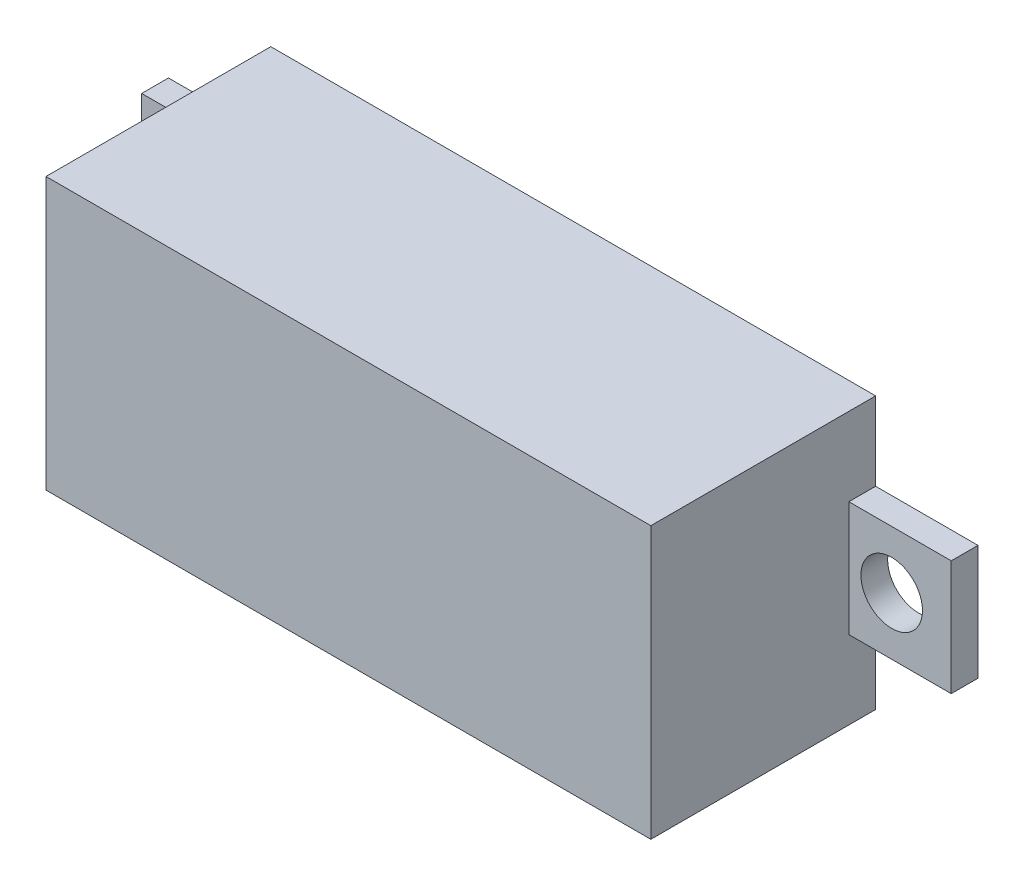
ISO-10303-21;
HEADER;
FILE_DESCRIPTION(('STEP AP214'),'2;1');
FILE_NAME('part.step','',(''),(''),'','','');
FILE_SCHEMA(('AUTOMOTIVE_DESIGN { 1 0 10303 214 1 1 1 1 }'));
ENDSEC;
DATA;
#1=APPLICATION_CONTEXT('core data for automotive mechanical design processes');
#2=APPLICATION_PROTOCOL_DEFINITION('international standard','automotive_design',2000,#1);
#3=PRODUCT_CONTEXT('',#1,'mechanical');
#4=PRODUCT('Part','Part','',(#3));
#5=PRODUCT_RELATED_PRODUCT_CATEGORY('part','',(#4));
#6=PRODUCT_DEFINITION_FORMATION('','',#4);
#7=PRODUCT_DEFINITION_CONTEXT('part definition',#1,'design');
#8=PRODUCT_DEFINITION('design','',#6,#7);
#9=PRODUCT_DEFINITION_SHAPE('','',#8);
#10=(LENGTH_UNIT() NAMED_UNIT(*) SI_UNIT(.MILLI.,.METRE.));
#11=(NAMED_UNIT(*) PLANE_ANGLE_UNIT() SI_UNIT($,.RADIAN.));
#12=(NAMED_UNIT(*) SI_UNIT($,.STERADIAN.) SOLID_ANGLE_UNIT());
#13=UNCERTAINTY_MEASURE_WITH_UNIT(LENGTH_MEASURE(1.E-05),#10,'distance_accuracy_value','');
#14=(GEOMETRIC_REPRESENTATION_CONTEXT(3) GLOBAL_UNCERTAINTY_ASSIGNED_CONTEXT((#13)) GLOBAL_UNIT_ASSIGNED_CONTEXT((#10,
#11,#12)) REPRESENTATION_CONTEXT('',''));
#15=CARTESIAN_POINT('',(0.,0.,0.));
#16=DIRECTION('',(0.,0.,1.));
#17=DIRECTION('',(1.,0.,0.));
#18=AXIS2_PLACEMENT_3D('',#15,#16,#17);
#19=CARTESIAN_POINT('',(0.,0.,1.));
#20=DIRECTION('',(0.,0.,1.));
#21=DIRECTION('',(1.,0.,0.));
#22=AXIS2_PLACEMENT_3D('',#19,#20,#21);
#23=PLANE('',#22);
#24=DIRECTION('',(0.,-1.,0.));
#25=VECTOR('',#24,1.);
#26=CARTESIAN_POINT('',(11.3,2.15,1.));
#27=LINE('',#26,#25);
#28=CARTESIAN_POINT('',(11.3,2.15,1.));
#29=VERTEX_POINT('',#28);
#30=CARTESIAN_POINT('',(11.3,-2.15,1.));
#31=VERTEX_POINT('',#30);
#32=EDGE_CURVE('E96',#29,#31,#27,.T.);
#33=ORIENTED_EDGE('',*,*,#32,.T.);
#34=DIRECTION('',(1.,0.,0.));
#35=VECTOR('',#34,1.);
#36=CARTESIAN_POINT('',(11.3,-2.15,1.));
#37=LINE('',#36,#35);
#38=CARTESIAN_POINT('',(15.125,-2.15,1.));
#39=VERTEX_POINT('',#38);
#40=EDGE_CURVE('E91',#31,#39,#37,.T.);
#41=ORIENTED_EDGE('',*,*,#40,.T.);
#42=DIRECTION('',(0.,1.,0.));
#43=VECTOR('',#42,1.);
#44=CARTESIAN_POINT('',(15.125,2.15,1.));
#45=LINE('',#44,#43);
#46=CARTESIAN_POINT('',(15.125,2.15,1.));
#47=VERTEX_POINT('',#46);
#48=EDGE_CURVE('E94',#39,#47,#45,.T.);
#49=ORIENTED_EDGE('',*,*,#48,.T.);
#50=DIRECTION('',(-1.,0.,0.));
#51=VECTOR('',#50,1.);
#52=CARTESIAN_POINT('',(11.3,2.15,1.));
#53=LINE('',#52,#51);
#54=EDGE_CURVE('E61',#47,#29,#53,.T.);
#55=ORIENTED_EDGE('',*,*,#54,.T.);
#56=EDGE_LOOP('',(#33,#41,#49,#55));
#57=FACE_BOUND('',#56,.T.);
#58=CARTESIAN_POINT('',(12.9,0.,1.));
#59=DIRECTION('',(0.,0.,1.));
#60=DIRECTION('',(1.,0.,0.));
#61=AXIS2_PLACEMENT_3D('',#58,#59,#60);
#62=CIRCLE('',#61,1.15);
#63=CARTESIAN_POINT('',(14.05,0.,1.));
#64=VERTEX_POINT('',#63);
#65=EDGE_CURVE('E111',#64,#64,#62,.T.);
#66=ORIENTED_EDGE('',*,*,#65,.F.);
#67=EDGE_LOOP('',(#66));
#68=FACE_BOUND('',#67,.T.);
#69=ADVANCED_FACE('F44',(#57,#68),#23,.T.);
#70=CARTESIAN_POINT('',(0.,0.,0.));
#71=DIRECTION('',(0.,0.,1.));
#72=DIRECTION('',(1.,0.,0.));
#73=AXIS2_PLACEMENT_3D('',#70,#71,#72);
#74=PLANE('',#73);
#75=DIRECTION('',(0.,-1.,0.));
#76=VECTOR('',#75,1.);
#77=CARTESIAN_POINT('',(11.3,2.15,0.));
#78=LINE('',#77,#76);
#79=CARTESIAN_POINT('',(11.3,2.15,0.));
#80=VERTEX_POINT('',#79);
#81=CARTESIAN_POINT('',(11.3,-2.15,0.));
#82=VERTEX_POINT('',#81);
#83=EDGE_CURVE('E108',#80,#82,#78,.T.);
#84=ORIENTED_EDGE('',*,*,#83,.F.);
#85=DIRECTION('',(-1.,0.,0.));
#86=VECTOR('',#85,1.);
#87=CARTESIAN_POINT('',(11.3,2.15,0.));
#88=LINE('',#87,#86);
#89=CARTESIAN_POINT('',(15.125,2.15,0.));
#90=VERTEX_POINT('',#89);
#91=EDGE_CURVE('E84',#90,#80,#88,.T.);
#92=ORIENTED_EDGE('',*,*,#91,.F.);
#93=DIRECTION('',(0.,1.,0.));
#94=VECTOR('',#93,1.);
#95=CARTESIAN_POINT('',(15.125,2.15,0.));
#96=LINE('',#95,#94);
#97=CARTESIAN_POINT('',(15.125,-2.15,0.));
#98=VERTEX_POINT('',#97);
#99=EDGE_CURVE('E78',#98,#90,#96,.T.);
#100=ORIENTED_EDGE('',*,*,#99,.F.);
#101=DIRECTION('',(1.,0.,0.));
#102=VECTOR('',#101,1.);
#103=CARTESIAN_POINT('',(11.3,-2.15,0.));
#104=LINE('',#103,#102);
#105=EDGE_CURVE('E100',#82,#98,#104,.T.);
#106=ORIENTED_EDGE('',*,*,#105,.F.);
#107=EDGE_LOOP('',(#84,#92,#100,#106));
#108=FACE_BOUND('',#107,.T.);
#109=CARTESIAN_POINT('',(12.9,0.,0.));
#110=DIRECTION('',(0.,0.,1.));
#111=DIRECTION('',(1.,0.,0.));
#112=AXIS2_PLACEMENT_3D('',#109,#110,#111);
#113=CIRCLE('',#112,1.15);
#114=CARTESIAN_POINT('',(14.05,0.,0.));
#115=VERTEX_POINT('',#114);
#116=EDGE_CURVE('E123',#115,#115,#113,.T.);
#117=ORIENTED_EDGE('',*,*,#116,.T.);
#118=EDGE_LOOP('',(#117));
#119=FACE_BOUND('',#118,.T.);
#120=ADVANCED_FACE('F119',(#108,#119),#74,.F.);
#121=CARTESIAN_POINT('',(11.3,2.15,1.));
#122=DIRECTION('',(1.,0.,0.));
#123=DIRECTION('',(0.,0.,-1.));
#124=AXIS2_PLACEMENT_3D('',#121,#122,#123);
#125=PLANE('',#124);
#126=ORIENTED_EDGE('',*,*,#83,.T.);
#127=DIRECTION('',(0.,0.,-1.));
#128=VECTOR('',#127,1.);
#129=CARTESIAN_POINT('',(11.3,-2.15,1.));
#130=LINE('',#129,#128);
#131=EDGE_CURVE('E12',#31,#82,#130,.T.);
#132=ORIENTED_EDGE('',*,*,#131,.F.);
#133=ORIENTED_EDGE('',*,*,#32,.F.);
#134=DIRECTION('',(0.,0.,-1.));
#135=VECTOR('',#134,1.);
#136=CARTESIAN_POINT('',(11.3,2.15,1.));
#137=LINE('',#136,#135);
#138=EDGE_CURVE('E104',#29,#80,#137,.T.);
#139=ORIENTED_EDGE('',*,*,#138,.T.);
#140=EDGE_LOOP('',(#126,#132,#133,#139));
#141=FACE_BOUND('',#140,.T.);
#142=ADVANCED_FACE('F46',(#141),#125,.F.);
#143=CARTESIAN_POINT('',(11.3,-2.15,1.));
#144=DIRECTION('',(0.,1.,0.));
#145=DIRECTION('',(0.,0.,1.));
#146=AXIS2_PLACEMENT_3D('',#143,#144,#145);
#147=PLANE('',#146);
#148=ORIENTED_EDGE('',*,*,#105,.T.);
#149=DIRECTION('',(0.,0.,-1.));
#150=VECTOR('',#149,1.);
#151=CARTESIAN_POINT('',(15.125,-2.15,1.));
#152=LINE('',#151,#150);
#153=EDGE_CURVE('E53',#39,#98,#152,.T.);
#154=ORIENTED_EDGE('',*,*,#153,.F.);
#155=ORIENTED_EDGE('',*,*,#40,.F.);
#156=ORIENTED_EDGE('',*,*,#131,.T.);
#157=EDGE_LOOP('',(#148,#154,#155,#156));
#158=FACE_BOUND('',#157,.T.);
#159=ADVANCED_FACE('F99',(#158),#147,.F.);
#160=CARTESIAN_POINT('',(15.125,2.15,1.));
#161=DIRECTION('',(-1.,0.,0.));
#162=DIRECTION('',(0.,0.,1.));
#163=AXIS2_PLACEMENT_3D('',#160,#161,#162);
#164=PLANE('',#163);
#165=ORIENTED_EDGE('',*,*,#99,.T.);
#166=DIRECTION('',(0.,0.,-1.));
#167=VECTOR('',#166,1.);
#168=CARTESIAN_POINT('',(15.125,2.15,1.));
#169=LINE('',#168,#167);
#170=EDGE_CURVE('E101',#47,#90,#169,.T.);
#171=ORIENTED_EDGE('',*,*,#170,.F.);
#172=ORIENTED_EDGE('',*,*,#48,.F.);
#173=ORIENTED_EDGE('',*,*,#153,.T.);
#174=EDGE_LOOP('',(#165,#171,#172,#173));
#175=FACE_BOUND('',#174,.T.);
#176=ADVANCED_FACE('F102',(#175),#164,.F.);
#177=CARTESIAN_POINT('',(11.3,2.15,1.));
#178=DIRECTION('',(0.,-1.,0.));
#179=DIRECTION('',(0.,0.,-1.));
#180=AXIS2_PLACEMENT_3D('',#177,#178,#179);
#181=PLANE('',#180);
#182=ORIENTED_EDGE('',*,*,#91,.T.);
#183=ORIENTED_EDGE('',*,*,#138,.F.);
#184=ORIENTED_EDGE('',*,*,#54,.F.);
#185=ORIENTED_EDGE('',*,*,#170,.T.);
#186=EDGE_LOOP('',(#182,#183,#184,#185));
#187=FACE_BOUND('',#186,.T.);
#188=ADVANCED_FACE('F116',(#187),#181,.F.);
#189=CARTESIAN_POINT('',(12.9,0.,1.));
#190=DIRECTION('',(0.,0.,-1.));
#191=DIRECTION('',(-1.,0.,0.));
#192=AXIS2_PLACEMENT_3D('',#189,#190,#191);
#193=CYLINDRICAL_SURFACE('',#192,1.15);
#194=ORIENTED_EDGE('',*,*,#65,.T.);
#195=EDGE_LOOP('',(#194));
#196=FACE_BOUND('',#195,.T.);
#197=ORIENTED_EDGE('',*,*,#116,.F.);
#198=EDGE_LOOP('',(#197));
#199=FACE_BOUND('',#198,.T.);
#200=ADVANCED_FACE('F129',(#196,#199),#193,.F.);
#201=CLOSED_SHELL('',(#69,#120,#142,#159,#176,#188,#200));
#202=MANIFOLD_SOLID_BREP('B2',#201);
#203=CARTESIAN_POINT('',(0.,0.,1.));
#204=DIRECTION('',(0.,0.,-1.));
#205=DIRECTION('',(-1.,0.,0.));
#206=AXIS2_PLACEMENT_3D('',#203,#204,#205);
#207=PLANE('',#206);
#208=DIRECTION('',(0.,1.,0.));
#209=VECTOR('',#208,1.);
#210=CARTESIAN_POINT('',(-11.3,2.15,1.));
#211=LINE('',#210,#209);
#212=CARTESIAN_POINT('',(-11.3,-2.15,1.));
#213=VERTEX_POINT('',#212);
#214=CARTESIAN_POINT('',(-11.3,2.15,1.));
#215=VERTEX_POINT('',#214);
#216=EDGE_CURVE('E250',#213,#215,#211,.T.);
#217=ORIENTED_EDGE('',*,*,#216,.T.);
#218=DIRECTION('',(-1.,0.,0.));
#219=VECTOR('',#218,1.);
#220=CARTESIAN_POINT('',(-11.3,2.15,1.));
#221=LINE('',#220,#219);
#222=CARTESIAN_POINT('',(-15.125,2.15,1.));
#223=VERTEX_POINT('',#222);
#224=EDGE_CURVE('E245',#215,#223,#221,.T.);
#225=ORIENTED_EDGE('',*,*,#224,.T.);
#226=DIRECTION('',(0.,-1.,0.));
#227=VECTOR('',#226,1.);
#228=CARTESIAN_POINT('',(-15.125,2.15,1.));
#229=LINE('',#228,#227);
#230=CARTESIAN_POINT('',(-15.125,-2.15,1.));
#231=VERTEX_POINT('',#230);
#232=EDGE_CURVE('E248',#223,#231,#229,.T.);
#233=ORIENTED_EDGE('',*,*,#232,.T.);
#234=DIRECTION('',(1.,0.,0.));
#235=VECTOR('',#234,1.);
#236=CARTESIAN_POINT('',(-11.3,-2.15,1.));
#237=LINE('',#236,#235);
#238=EDGE_CURVE('E215',#231,#213,#237,.T.);
#239=ORIENTED_EDGE('',*,*,#238,.T.);
#240=EDGE_LOOP('',(#217,#225,#233,#239));
#241=FACE_BOUND('',#240,.T.);
#242=CARTESIAN_POINT('',(-12.9,0.,1.));
#243=DIRECTION('',(0.,0.,1.));
#244=DIRECTION('',(1.,0.,0.));
#245=AXIS2_PLACEMENT_3D('',#242,#243,#244);
#246=CIRCLE('',#245,1.15);
#247=CARTESIAN_POINT('',(-11.75,0.,1.));
#248=VERTEX_POINT('',#247);
#249=EDGE_CURVE('E265',#248,#248,#246,.T.);
#250=ORIENTED_EDGE('',*,*,#249,.F.);
#251=EDGE_LOOP('',(#250));
#252=FACE_BOUND('',#251,.T.);
#253=ADVANCED_FACE('F198',(#241,#252),#207,.F.);
#254=CARTESIAN_POINT('',(0.,0.,0.));
#255=DIRECTION('',(0.,0.,-1.));
#256=DIRECTION('',(-1.,0.,0.));
#257=AXIS2_PLACEMENT_3D('',#254,#255,#256);
#258=PLANE('',#257);
#259=DIRECTION('',(0.,1.,0.));
#260=VECTOR('',#259,1.);
#261=CARTESIAN_POINT('',(-11.3,2.15,0.));
#262=LINE('',#261,#260);
#263=CARTESIAN_POINT('',(-11.3,-2.15,0.));
#264=VERTEX_POINT('',#263);
#265=CARTESIAN_POINT('',(-11.3,2.15,0.));
#266=VERTEX_POINT('',#265);
#267=EDGE_CURVE('E262',#264,#266,#262,.T.);
#268=ORIENTED_EDGE('',*,*,#267,.F.);
#269=DIRECTION('',(1.,0.,0.));
#270=VECTOR('',#269,1.);
#271=CARTESIAN_POINT('',(-11.3,-2.15,0.));
#272=LINE('',#271,#270);
#273=CARTESIAN_POINT('',(-15.125,-2.15,0.));
#274=VERTEX_POINT('',#273);
#275=EDGE_CURVE('E238',#274,#264,#272,.T.);
#276=ORIENTED_EDGE('',*,*,#275,.F.);
#277=DIRECTION('',(0.,-1.,0.));
#278=VECTOR('',#277,1.);
#279=CARTESIAN_POINT('',(-15.125,2.15,0.));
#280=LINE('',#279,#278);
#281=CARTESIAN_POINT('',(-15.125,2.15,0.));
#282=VERTEX_POINT('',#281);
#283=EDGE_CURVE('E232',#282,#274,#280,.T.);
#284=ORIENTED_EDGE('',*,*,#283,.F.);
#285=DIRECTION('',(-1.,0.,0.));
#286=VECTOR('',#285,1.);
#287=CARTESIAN_POINT('',(-11.3,2.15,0.));
#288=LINE('',#287,#286);
#289=EDGE_CURVE('E254',#266,#282,#288,.T.);
#290=ORIENTED_EDGE('',*,*,#289,.F.);
#291=EDGE_LOOP('',(#268,#276,#284,#290));
#292=FACE_BOUND('',#291,.T.);
#293=CARTESIAN_POINT('',(-12.9,0.,0.));
#294=DIRECTION('',(0.,0.,1.));
#295=DIRECTION('',(1.,0.,0.));
#296=AXIS2_PLACEMENT_3D('',#293,#294,#295);
#297=CIRCLE('',#296,1.15);
#298=CARTESIAN_POINT('',(-11.75,0.,0.));
#299=VERTEX_POINT('',#298);
#300=EDGE_CURVE('E277',#299,#299,#297,.T.);
#301=ORIENTED_EDGE('',*,*,#300,.T.);
#302=EDGE_LOOP('',(#301));
#303=FACE_BOUND('',#302,.T.);
#304=ADVANCED_FACE('F273',(#292,#303),#258,.T.);
#305=CARTESIAN_POINT('',(-11.3,2.15,1.));
#306=DIRECTION('',(-1.,0.,0.));
#307=DIRECTION('',(0.,0.,1.));
#308=AXIS2_PLACEMENT_3D('',#305,#306,#307);
#309=PLANE('',#308);
#310=ORIENTED_EDGE('',*,*,#267,.T.);
#311=DIRECTION('',(0.,0.,-1.));
#312=VECTOR('',#311,1.);
#313=CARTESIAN_POINT('',(-11.3,2.15,1.));
#314=LINE('',#313,#312);
#315=EDGE_CURVE('E42',#215,#266,#314,.T.);
#316=ORIENTED_EDGE('',*,*,#315,.F.);
#317=ORIENTED_EDGE('',*,*,#216,.F.);
#318=DIRECTION('',(0.,0.,-1.));
#319=VECTOR('',#318,1.);
#320=CARTESIAN_POINT('',(-11.3,-2.15,1.));
#321=LINE('',#320,#319);
#322=EDGE_CURVE('E258',#213,#264,#321,.T.);
#323=ORIENTED_EDGE('',*,*,#322,.T.);
#324=EDGE_LOOP('',(#310,#316,#317,#323));
#325=FACE_BOUND('',#324,.T.);
#326=ADVANCED_FACE('F200',(#325),#309,.F.);
#327=CARTESIAN_POINT('',(-11.3,2.15,1.));
#328=DIRECTION('',(0.,-1.,0.));
#329=DIRECTION('',(1.,0.,0.));
#330=AXIS2_PLACEMENT_3D('',#327,#328,#329);
#331=PLANE('',#330);
#332=ORIENTED_EDGE('',*,*,#289,.T.);
#333=DIRECTION('',(0.,0.,-1.));
#334=VECTOR('',#333,1.);
#335=CARTESIAN_POINT('',(-15.125,2.15,1.));
#336=LINE('',#335,#334);
#337=EDGE_CURVE('E207',#223,#282,#336,.T.);
#338=ORIENTED_EDGE('',*,*,#337,.F.);
#339=ORIENTED_EDGE('',*,*,#224,.F.);
#340=ORIENTED_EDGE('',*,*,#315,.T.);
#341=EDGE_LOOP('',(#332,#338,#339,#340));
#342=FACE_BOUND('',#341,.T.);
#343=ADVANCED_FACE('F253',(#342),#331,.F.);
#344=CARTESIAN_POINT('',(-15.125,2.15,1.));
#345=DIRECTION('',(1.,0.,0.));
#346=DIRECTION('',(0.,0.,-1.));
#347=AXIS2_PLACEMENT_3D('',#344,#345,#346);
#348=PLANE('',#347);
#349=ORIENTED_EDGE('',*,*,#283,.T.);
#350=DIRECTION('',(0.,0.,-1.));
#351=VECTOR('',#350,1.);
#352=CARTESIAN_POINT('',(-15.125,-2.15,1.));
#353=LINE('',#352,#351);
#354=EDGE_CURVE('E255',#231,#274,#353,.T.);
#355=ORIENTED_EDGE('',*,*,#354,.F.);
#356=ORIENTED_EDGE('',*,*,#232,.F.);
#357=ORIENTED_EDGE('',*,*,#337,.T.);
#358=EDGE_LOOP('',(#349,#355,#356,#357));
#359=FACE_BOUND('',#358,.T.);
#360=ADVANCED_FACE('F256',(#359),#348,.F.);
#361=CARTESIAN_POINT('',(-11.3,-2.15,1.));
#362=DIRECTION('',(0.,1.,0.));
#363=DIRECTION('',(-1.,0.,0.));
#364=AXIS2_PLACEMENT_3D('',#361,#362,#363);
#365=PLANE('',#364);
#366=ORIENTED_EDGE('',*,*,#275,.T.);
#367=ORIENTED_EDGE('',*,*,#322,.F.);
#368=ORIENTED_EDGE('',*,*,#238,.F.);
#369=ORIENTED_EDGE('',*,*,#354,.T.);
#370=EDGE_LOOP('',(#366,#367,#368,#369));
#371=FACE_BOUND('',#370,.T.);
#372=ADVANCED_FACE('F270',(#371),#365,.F.);
#373=CARTESIAN_POINT('',(-12.9,0.,1.));
#374=DIRECTION('',(0.,0.,-1.));
#375=DIRECTION('',(-1.,0.,0.));
#376=AXIS2_PLACEMENT_3D('',#373,#374,#375);
#377=CYLINDRICAL_SURFACE('',#376,1.15);
#378=ORIENTED_EDGE('',*,*,#249,.T.);
#379=EDGE_LOOP('',(#378));
#380=FACE_BOUND('',#379,.T.);
#381=ORIENTED_EDGE('',*,*,#300,.F.);
#382=EDGE_LOOP('',(#381));
#383=FACE_BOUND('',#382,.T.);
#384=ADVANCED_FACE('F283',(#380,#383),#377,.F.);
#385=CLOSED_SHELL('',(#253,#304,#326,#343,#360,#372,#384));
#386=MANIFOLD_SOLID_BREP('B6',#385);
#387=CARTESIAN_POINT('',(-11.3,5.075,8.4));
#388=DIRECTION('',(1.,0.,0.));
#389=DIRECTION('',(0.,0.,-1.));
#390=AXIS2_PLACEMENT_3D('',#387,#388,#389);
#391=PLANE('',#390);
#392=DIRECTION('',(0.,-1.,0.));
#393=VECTOR('',#392,1.);
#394=CARTESIAN_POINT('',(-11.3,5.075,0.));
#395=LINE('',#394,#393);
#396=CARTESIAN_POINT('',(-11.3,5.075,0.));
#397=VERTEX_POINT('',#396);
#398=CARTESIAN_POINT('',(-11.3,-5.075,0.));
#399=VERTEX_POINT('',#398);
#400=EDGE_CURVE('E405',#397,#399,#395,.T.);
#401=ORIENTED_EDGE('',*,*,#400,.T.);
#402=DIRECTION('',(0.,0.,-1.));
#403=VECTOR('',#402,1.);
#404=CARTESIAN_POINT('',(-11.3,-5.075,8.4));
#405=LINE('',#404,#403);
#406=CARTESIAN_POINT('',(-11.3,-5.075,8.4));
#407=VERTEX_POINT('',#406);
#408=EDGE_CURVE('E196',#407,#399,#405,.T.);
#409=ORIENTED_EDGE('',*,*,#408,.F.);
#410=DIRECTION('',(0.,-1.,0.));
#411=VECTOR('',#410,1.);
#412=CARTESIAN_POINT('',(-11.3,5.075,8.4));
#413=LINE('',#412,#411);
#414=CARTESIAN_POINT('',(-11.3,5.075,8.4));
#415=VERTEX_POINT('',#414);
#416=EDGE_CURVE('E393',#415,#407,#413,.T.);
#417=ORIENTED_EDGE('',*,*,#416,.F.);
#418=DIRECTION('',(0.,0.,-1.));
#419=VECTOR('',#418,1.);
#420=CARTESIAN_POINT('',(-11.3,5.075,8.4));
#421=LINE('',#420,#419);
#422=EDGE_CURVE('E401',#415,#397,#421,.T.);
#423=ORIENTED_EDGE('',*,*,#422,.T.);
#424=EDGE_LOOP('',(#401,#409,#417,#423));
#425=FACE_BOUND('',#424,.T.);
#426=ADVANCED_FACE('F342',(#425),#391,.F.);
#427=CARTESIAN_POINT('',(-11.3,-5.075,8.4));
#428=DIRECTION('',(0.,1.,0.));
#429=DIRECTION('',(-1.,0.,0.));
#430=AXIS2_PLACEMENT_3D('',#427,#428,#429);
#431=PLANE('',#430);
#432=DIRECTION('',(1.,0.,0.));
#433=VECTOR('',#432,1.);
#434=CARTESIAN_POINT('',(-11.3,-5.075,0.));
#435=LINE('',#434,#433);
#436=CARTESIAN_POINT('',(11.3,-5.075,0.));
#437=VERTEX_POINT('',#436);
#438=EDGE_CURVE('E397',#399,#437,#435,.T.);
#439=ORIENTED_EDGE('',*,*,#438,.T.);
#440=DIRECTION('',(0.,0.,-1.));
#441=VECTOR('',#440,1.);
#442=CARTESIAN_POINT('',(11.3,-5.075,8.4));
#443=LINE('',#442,#441);
#444=CARTESIAN_POINT('',(11.3,-5.075,8.4));
#445=VERTEX_POINT('',#444);
#446=EDGE_CURVE('E350',#445,#437,#443,.T.);
#447=ORIENTED_EDGE('',*,*,#446,.F.);
#448=DIRECTION('',(1.,0.,0.));
#449=VECTOR('',#448,1.);
#450=CARTESIAN_POINT('',(-11.3,-5.075,8.4));
#451=LINE('',#450,#449);
#452=EDGE_CURVE('E388',#407,#445,#451,.T.);
#453=ORIENTED_EDGE('',*,*,#452,.F.);
#454=ORIENTED_EDGE('',*,*,#408,.T.);
#455=EDGE_LOOP('',(#439,#447,#453,#454));
#456=FACE_BOUND('',#455,.T.);
#457=ADVANCED_FACE('F396',(#456),#431,.F.);
#458=CARTESIAN_POINT('',(11.3,5.075,8.4));
#459=DIRECTION('',(-1.,0.,0.));
#460=DIRECTION('',(0.,0.,1.));
#461=AXIS2_PLACEMENT_3D('',#458,#459,#460);
#462=PLANE('',#461);
#463=DIRECTION('',(0.,1.,0.));
#464=VECTOR('',#463,1.);
#465=CARTESIAN_POINT('',(11.3,5.075,0.));
#466=LINE('',#465,#464);
#467=CARTESIAN_POINT('',(11.3,5.075,0.));
#468=VERTEX_POINT('',#467);
#469=EDGE_CURVE('E375',#437,#468,#466,.T.);
#470=ORIENTED_EDGE('',*,*,#469,.T.);
#471=DIRECTION('',(0.,0.,-1.));
#472=VECTOR('',#471,1.);
#473=CARTESIAN_POINT('',(11.3,5.075,8.4));
#474=LINE('',#473,#472);
#475=CARTESIAN_POINT('',(11.3,5.075,8.4));
#476=VERTEX_POINT('',#475);
#477=EDGE_CURVE('E398',#476,#468,#474,.T.);
#478=ORIENTED_EDGE('',*,*,#477,.F.);
#479=DIRECTION('',(0.,1.,0.));
#480=VECTOR('',#479,1.);
#481=CARTESIAN_POINT('',(11.3,5.075,8.4));
#482=LINE('',#481,#480);
#483=EDGE_CURVE('E391',#445,#476,#482,.T.);
#484=ORIENTED_EDGE('',*,*,#483,.F.);
#485=ORIENTED_EDGE('',*,*,#446,.T.);
#486=EDGE_LOOP('',(#470,#478,#484,#485));
#487=FACE_BOUND('',#486,.T.);
#488=ADVANCED_FACE('F399',(#487),#462,.F.);
#489=CARTESIAN_POINT('',(-11.3,5.075,8.4));
#490=DIRECTION('',(0.,-1.,0.));
#491=DIRECTION('',(0.,0.,-1.));
#492=AXIS2_PLACEMENT_3D('',#489,#490,#491);
#493=PLANE('',#492);
#494=DIRECTION('',(-1.,0.,0.));
#495=VECTOR('',#494,1.);
#496=CARTESIAN_POINT('',(-11.3,5.075,0.));
#497=LINE('',#496,#495);
#498=EDGE_CURVE('E381',#468,#397,#497,.T.);
#499=ORIENTED_EDGE('',*,*,#498,.T.);
#500=ORIENTED_EDGE('',*,*,#422,.F.);
#501=DIRECTION('',(-1.,0.,0.));
#502=VECTOR('',#501,1.);
#503=CARTESIAN_POINT('',(-11.3,5.075,8.4));
#504=LINE('',#503,#502);
#505=EDGE_CURVE('E358',#476,#415,#504,.T.);
#506=ORIENTED_EDGE('',*,*,#505,.F.);
#507=ORIENTED_EDGE('',*,*,#477,.T.);
#508=EDGE_LOOP('',(#499,#500,#506,#507));
#509=FACE_BOUND('',#508,.T.);
#510=ADVANCED_FACE('F412',(#509),#493,.F.);
#511=CARTESIAN_POINT('',(0.,0.,8.4));
#512=DIRECTION('',(0.,0.,1.));
#513=DIRECTION('',(1.,0.,0.));
#514=AXIS2_PLACEMENT_3D('',#511,#512,#513);
#515=PLANE('',#514);
#516=ORIENTED_EDGE('',*,*,#416,.T.);
#517=ORIENTED_EDGE('',*,*,#452,.T.);
#518=ORIENTED_EDGE('',*,*,#483,.T.);
#519=ORIENTED_EDGE('',*,*,#505,.T.);
#520=EDGE_LOOP('',(#516,#517,#518,#519));
#521=FACE_BOUND('',#520,.T.);
#522=ADVANCED_FACE('F389',(#521),#515,.T.);
#523=CARTESIAN_POINT('',(0.,0.,0.));
#524=DIRECTION('',(0.,0.,1.));
#525=DIRECTION('',(1.,0.,0.));
#526=AXIS2_PLACEMENT_3D('',#523,#524,#525);
#527=PLANE('',#526);
#528=ORIENTED_EDGE('',*,*,#400,.F.);
#529=ORIENTED_EDGE('',*,*,#498,.F.);
#530=ORIENTED_EDGE('',*,*,#469,.F.);
#531=ORIENTED_EDGE('',*,*,#438,.F.);
#532=EDGE_LOOP('',(#528,#529,#530,#531));
#533=FACE_BOUND('',#532,.T.);
#534=ADVANCED_FACE('F415',(#533),#527,.F.);
#535=CLOSED_SHELL('',(#426,#457,#488,#510,#522,#534));
#536=MANIFOLD_SOLID_BREP('B36',#535);
#537=ADVANCED_BREP_SHAPE_REPRESENTATION('',(#18,#202,#386,#536),#14);
#538=SHAPE_DEFINITION_REPRESENTATION(#9,#537);
ENDSEC;
END-ISO-10303-21;
